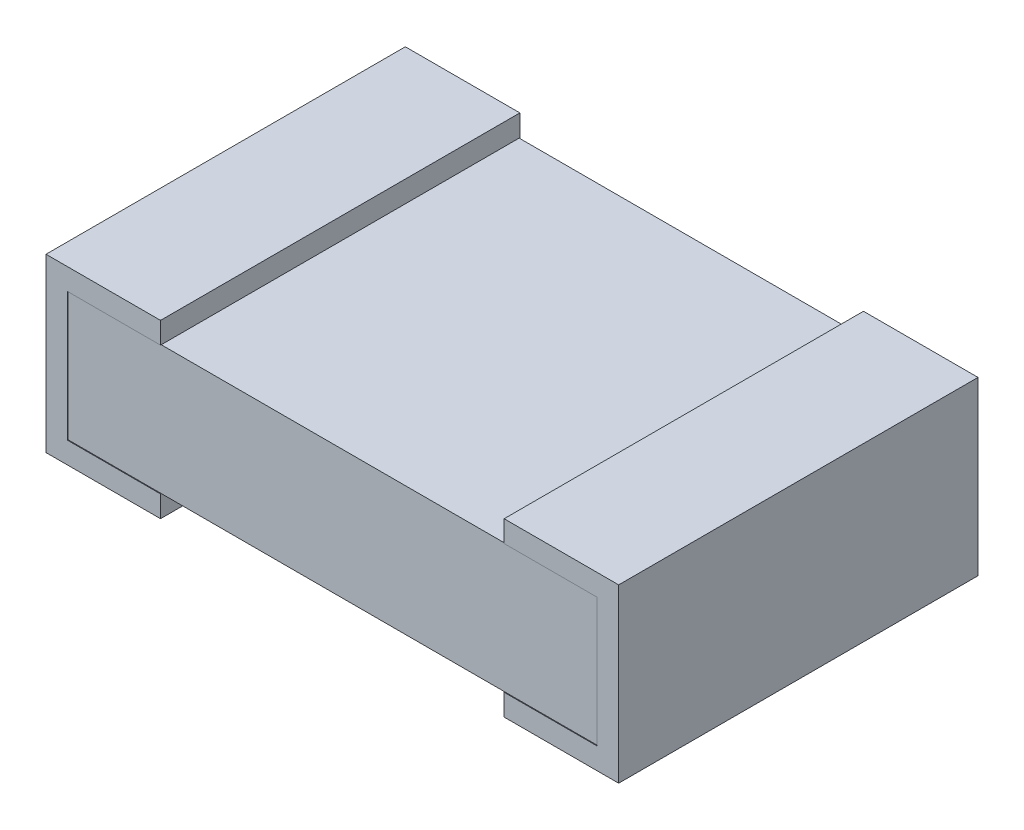
ISO-10303-21;
HEADER;
FILE_DESCRIPTION(('STEP AP214'),'2;1');
FILE_NAME('part.step','',(''),(''),'','','');
FILE_SCHEMA(('AUTOMOTIVE_DESIGN { 1 0 10303 214 1 1 1 1 }'));
ENDSEC;
DATA;
#1=APPLICATION_CONTEXT('core data for automotive mechanical design processes');
#2=APPLICATION_PROTOCOL_DEFINITION('international standard','automotive_design',2000,#1);
#3=PRODUCT_CONTEXT('',#1,'mechanical');
#4=PRODUCT('Part','Part','',(#3));
#5=PRODUCT_RELATED_PRODUCT_CATEGORY('part','',(#4));
#6=PRODUCT_DEFINITION_FORMATION('','',#4);
#7=PRODUCT_DEFINITION_CONTEXT('part definition',#1,'design');
#8=PRODUCT_DEFINITION('design','',#6,#7);
#9=PRODUCT_DEFINITION_SHAPE('','',#8);
#10=(LENGTH_UNIT() NAMED_UNIT(*) SI_UNIT(.MILLI.,.METRE.));
#11=(NAMED_UNIT(*) PLANE_ANGLE_UNIT() SI_UNIT($,.RADIAN.));
#12=(NAMED_UNIT(*) SI_UNIT($,.STERADIAN.) SOLID_ANGLE_UNIT());
#13=UNCERTAINTY_MEASURE_WITH_UNIT(LENGTH_MEASURE(1.E-05),#10,'distance_accuracy_value','');
#14=(GEOMETRIC_REPRESENTATION_CONTEXT(3) GLOBAL_UNCERTAINTY_ASSIGNED_CONTEXT((#13)) GLOBAL_UNIT_ASSIGNED_CONTEXT((#10,
#11,#12)) REPRESENTATION_CONTEXT('',''));
#15=CARTESIAN_POINT('',(0.,0.,0.));
#16=DIRECTION('',(0.,0.,1.));
#17=DIRECTION('',(1.,0.,0.));
#18=AXIS2_PLACEMENT_3D('',#15,#16,#17);
#19=CARTESIAN_POINT('',(1.9558,0.0762000000000002,-0.635));
#20=DIRECTION('',(0.,-1.,0.));
#21=DIRECTION('',(1.,0.,0.));
#22=AXIS2_PLACEMENT_3D('',#19,#20,#21);
#23=PLANE('',#22);
#24=DIRECTION('',(1.,0.,0.));
#25=VECTOR('',#24,1.);
#26=CARTESIAN_POINT('',(1.9558,0.0762000000000002,-0.635));
#27=LINE('',#26,#25);
#28=CARTESIAN_POINT('',(0.4064,0.0762000000000001,-0.635));
#29=VERTEX_POINT('',#28);
#30=CARTESIAN_POINT('',(1.6256,0.0762000000000001,-0.635));
#31=VERTEX_POINT('',#30);
#32=EDGE_CURVE('E40',#29,#31,#27,.T.);
#33=ORIENTED_EDGE('',*,*,#32,.T.);
#34=DIRECTION('',(0.,0.,-1.));
#35=VECTOR('',#34,1.);
#36=CARTESIAN_POINT('',(1.6256,0.0762000000000001,0.63754));
#37=LINE('',#36,#35);
#38=CARTESIAN_POINT('',(1.6256,0.0762000000000001,0.635));
#39=VERTEX_POINT('',#38);
#40=EDGE_CURVE('E271',#39,#31,#37,.T.);
#41=ORIENTED_EDGE('',*,*,#40,.F.);
#42=DIRECTION('',(1.,0.,0.));
#43=VECTOR('',#42,1.);
#44=CARTESIAN_POINT('',(1.9558,0.0762000000000002,0.635));
#45=LINE('',#44,#43);
#46=CARTESIAN_POINT('',(0.4064,0.0762000000000001,0.635));
#47=VERTEX_POINT('',#46);
#48=EDGE_CURVE('E370',#47,#39,#45,.T.);
#49=ORIENTED_EDGE('',*,*,#48,.F.);
#50=DIRECTION('',(0.,0.,-1.));
#51=VECTOR('',#50,1.);
#52=CARTESIAN_POINT('',(0.4064,0.0762000000000001,0.63754));
#53=LINE('',#52,#51);
#54=EDGE_CURVE('E332',#47,#29,#53,.T.);
#55=ORIENTED_EDGE('',*,*,#54,.T.);
#56=EDGE_LOOP('',(#33,#41,#49,#55));
#57=FACE_BOUND('',#56,.T.);
#58=ADVANCED_FACE('F31',(#57),#23,.T.);
#59=CARTESIAN_POINT('',(0.0762,0.5334,-0.635));
#60=DIRECTION('',(0.,1.,0.));
#61=DIRECTION('',(-1.,0.,0.));
#62=AXIS2_PLACEMENT_3D('',#59,#60,#61);
#63=PLANE('',#62);
#64=DIRECTION('',(-1.,0.,0.));
#65=VECTOR('',#64,1.);
#66=CARTESIAN_POINT('',(0.0762,0.5334,0.635));
#67=LINE('',#66,#65);
#68=CARTESIAN_POINT('',(1.6256,0.5334,0.635));
#69=VERTEX_POINT('',#68);
#70=CARTESIAN_POINT('',(0.4064,0.5334,0.635));
#71=VERTEX_POINT('',#70);
#72=EDGE_CURVE('E363',#69,#71,#67,.T.);
#73=ORIENTED_EDGE('',*,*,#72,.F.);
#74=DIRECTION('',(0.,0.,-1.));
#75=VECTOR('',#74,1.);
#76=CARTESIAN_POINT('',(1.6256,0.5334,0.63754));
#77=LINE('',#76,#75);
#78=CARTESIAN_POINT('',(1.6256,0.5334,-0.635));
#79=VERTEX_POINT('',#78);
#80=EDGE_CURVE('E260',#69,#79,#77,.T.);
#81=ORIENTED_EDGE('',*,*,#80,.T.);
#82=DIRECTION('',(-1.,0.,0.));
#83=VECTOR('',#82,1.);
#84=CARTESIAN_POINT('',(0.0762,0.5334,-0.635));
#85=LINE('',#84,#83);
#86=CARTESIAN_POINT('',(0.4064,0.5334,-0.635));
#87=VERTEX_POINT('',#86);
#88=EDGE_CURVE('E352',#79,#87,#85,.T.);
#89=ORIENTED_EDGE('',*,*,#88,.T.);
#90=DIRECTION('',(0.,0.,-1.));
#91=VECTOR('',#90,1.);
#92=CARTESIAN_POINT('',(0.4064,0.5334,0.63754));
#93=LINE('',#92,#91);
#94=EDGE_CURVE('E343',#71,#87,#93,.T.);
#95=ORIENTED_EDGE('',*,*,#94,.F.);
#96=EDGE_LOOP('',(#73,#81,#89,#95));
#97=FACE_BOUND('',#96,.T.);
#98=ADVANCED_FACE('F33',(#97),#63,.T.);
#99=CARTESIAN_POINT('',(1.9558,0.5334,-0.635));
#100=DIRECTION('',(0.,0.,-1.));
#101=DIRECTION('',(-1.,0.,0.));
#102=AXIS2_PLACEMENT_3D('',#99,#100,#101);
#103=PLANE('',#102);
#104=DIRECTION('',(0.,1.,0.));
#105=VECTOR('',#104,1.);
#106=CARTESIAN_POINT('',(1.9558,0.0762000000000002,-0.635));
#107=LINE('',#106,#105);
#108=CARTESIAN_POINT('',(1.9558,0.0762,-0.635));
#109=VERTEX_POINT('',#108);
#110=CARTESIAN_POINT('',(1.9558,0.5334,-0.635));
#111=VERTEX_POINT('',#110);
#112=EDGE_CURVE('E350',#109,#111,#107,.T.);
#113=ORIENTED_EDGE('',*,*,#112,.F.);
#114=DIRECTION('',(-1.,0.,0.));
#115=VECTOR('',#114,1.);
#116=CARTESIAN_POINT('',(1.9558,0.0762,-0.635));
#117=LINE('',#116,#115);
#118=EDGE_CURVE('E253',#109,#31,#117,.T.);
#119=ORIENTED_EDGE('',*,*,#118,.T.);
#120=ORIENTED_EDGE('',*,*,#32,.F.);
#121=CARTESIAN_POINT('',(0.0762,0.0762,-0.635));
#122=VERTEX_POINT('',#121);
#123=EDGE_CURVE('E11',#122,#29,#27,.T.);
#124=ORIENTED_EDGE('',*,*,#123,.F.);
#125=DIRECTION('',(0.,-1.,0.));
#126=VECTOR('',#125,1.);
#127=CARTESIAN_POINT('',(0.0762,0.5334,-0.635));
#128=LINE('',#127,#126);
#129=CARTESIAN_POINT('',(0.0762,0.5334,-0.635));
#130=VERTEX_POINT('',#129);
#131=EDGE_CURVE('E355',#130,#122,#128,.T.);
#132=ORIENTED_EDGE('',*,*,#131,.F.);
#133=DIRECTION('',(-1.,0.,0.));
#134=VECTOR('',#133,1.);
#135=CARTESIAN_POINT('',(1.9558,0.5334,-0.635));
#136=LINE('',#135,#134);
#137=EDGE_CURVE('E326',#87,#130,#136,.T.);
#138=ORIENTED_EDGE('',*,*,#137,.F.);
#139=ORIENTED_EDGE('',*,*,#88,.F.);
#140=EDGE_CURVE('E353',#111,#79,#85,.T.);
#141=ORIENTED_EDGE('',*,*,#140,.F.);
#142=EDGE_LOOP('',(#113,#119,#120,#124,#132,#138,#139,#141));
#143=FACE_BOUND('',#142,.T.);
#144=ADVANCED_FACE('F434',(#143),#103,.T.);
#145=CARTESIAN_POINT('',(1.9558,0.5334,0.635));
#146=DIRECTION('',(0.,0.,-1.));
#147=DIRECTION('',(-1.,0.,0.));
#148=AXIS2_PLACEMENT_3D('',#145,#146,#147);
#149=PLANE('',#148);
#150=DIRECTION('',(0.,1.,0.));
#151=VECTOR('',#150,1.);
#152=CARTESIAN_POINT('',(1.9558,0.0762000000000002,0.635));
#153=LINE('',#152,#151);
#154=CARTESIAN_POINT('',(1.9558,0.0762000000000002,0.635));
#155=VERTEX_POINT('',#154);
#156=CARTESIAN_POINT('',(1.9558,0.5334,0.635));
#157=VERTEX_POINT('',#156);
#158=EDGE_CURVE('E349',#155,#157,#153,.T.);
#159=ORIENTED_EDGE('',*,*,#158,.T.);
#160=EDGE_CURVE('E360',#157,#69,#67,.T.);
#161=ORIENTED_EDGE('',*,*,#160,.T.);
#162=ORIENTED_EDGE('',*,*,#72,.T.);
#163=CARTESIAN_POINT('',(0.0762,0.5334,0.635));
#164=VERTEX_POINT('',#163);
#165=EDGE_CURVE('E359',#71,#164,#67,.T.);
#166=ORIENTED_EDGE('',*,*,#165,.T.);
#167=DIRECTION('',(0.,-1.,0.));
#168=VECTOR('',#167,1.);
#169=CARTESIAN_POINT('',(0.0762,0.5334,0.635));
#170=LINE('',#169,#168);
#171=CARTESIAN_POINT('',(0.0762,0.0762,0.635));
#172=VERTEX_POINT('',#171);
#173=EDGE_CURVE('E362',#164,#172,#170,.T.);
#174=ORIENTED_EDGE('',*,*,#173,.T.);
#175=EDGE_CURVE('E35',#172,#47,#45,.T.);
#176=ORIENTED_EDGE('',*,*,#175,.T.);
#177=ORIENTED_EDGE('',*,*,#48,.T.);
#178=EDGE_CURVE('E365',#39,#155,#45,.T.);
#179=ORIENTED_EDGE('',*,*,#178,.T.);
#180=EDGE_LOOP('',(#159,#161,#162,#166,#174,#176,#177,#179));
#181=FACE_BOUND('',#180,.T.);
#182=ADVANCED_FACE('F372',(#181),#149,.F.);
#183=CARTESIAN_POINT('',(0.0762,0.0762,0.63754));
#184=DIRECTION('',(0.,1.,0.));
#185=DIRECTION('',(-1.,0.,0.));
#186=AXIS2_PLACEMENT_3D('',#183,#184,#185);
#187=PLANE('',#186);
#188=ORIENTED_EDGE('',*,*,#175,.F.);
#189=DIRECTION('',(0.,0.,-1.));
#190=VECTOR('',#189,1.);
#191=CARTESIAN_POINT('',(0.0762,0.0762,0.63754));
#192=LINE('',#191,#190);
#193=CARTESIAN_POINT('',(0.0762,0.0762,0.63754));
#194=VERTEX_POINT('',#193);
#195=EDGE_CURVE('E334',#194,#172,#192,.T.);
#196=ORIENTED_EDGE('',*,*,#195,.F.);
#197=DIRECTION('',(1.,0.,0.));
#198=VECTOR('',#197,1.);
#199=CARTESIAN_POINT('',(0.0762,0.0762,0.63754));
#200=LINE('',#199,#198);
#201=CARTESIAN_POINT('',(0.4064,0.0762000000000001,0.63754));
#202=VERTEX_POINT('',#201);
#203=EDGE_CURVE('E292',#194,#202,#200,.T.);
#204=ORIENTED_EDGE('',*,*,#203,.T.);
#205=EDGE_CURVE('E329',#202,#47,#53,.T.);
#206=ORIENTED_EDGE('',*,*,#205,.T.);
#207=EDGE_LOOP('',(#188,#196,#204,#206));
#208=FACE_BOUND('',#207,.T.);
#209=ADVANCED_FACE('F375',(#208),#187,.T.);
#210=CARTESIAN_POINT('',(0.0762,0.5334,0.63754));
#211=DIRECTION('',(1.,0.,0.));
#212=DIRECTION('',(0.,0.,-1.));
#213=AXIS2_PLACEMENT_3D('',#210,#211,#212);
#214=PLANE('',#213);
#215=ORIENTED_EDGE('',*,*,#173,.F.);
#216=DIRECTION('',(0.,0.,-1.));
#217=VECTOR('',#216,1.);
#218=CARTESIAN_POINT('',(0.0762,0.5334,0.63754));
#219=LINE('',#218,#217);
#220=CARTESIAN_POINT('',(0.0762,0.5334,0.63754));
#221=VERTEX_POINT('',#220);
#222=EDGE_CURVE('E56',#221,#164,#219,.T.);
#223=ORIENTED_EDGE('',*,*,#222,.F.);
#224=DIRECTION('',(0.,-1.,0.));
#225=VECTOR('',#224,1.);
#226=CARTESIAN_POINT('',(0.0762,0.5334,0.63754));
#227=LINE('',#226,#225);
#228=EDGE_CURVE('E289',#221,#194,#227,.T.);
#229=ORIENTED_EDGE('',*,*,#228,.T.);
#230=ORIENTED_EDGE('',*,*,#195,.T.);
#231=EDGE_LOOP('',(#215,#223,#229,#230));
#232=FACE_BOUND('',#231,.T.);
#233=ADVANCED_FACE('F378',(#232),#214,.T.);
#234=CARTESIAN_POINT('',(0.4064,0.5334,0.63754));
#235=DIRECTION('',(0.,-1.,0.));
#236=DIRECTION('',(0.,0.,-1.));
#237=AXIS2_PLACEMENT_3D('',#234,#235,#236);
#238=PLANE('',#237);
#239=ORIENTED_EDGE('',*,*,#165,.F.);
#240=CARTESIAN_POINT('',(0.4064,0.5334,0.63754));
#241=VERTEX_POINT('',#240);
#242=EDGE_CURVE('E340',#241,#71,#93,.T.);
#243=ORIENTED_EDGE('',*,*,#242,.F.);
#244=DIRECTION('',(-1.,0.,0.));
#245=VECTOR('',#244,1.);
#246=CARTESIAN_POINT('',(0.4064,0.5334,0.63754));
#247=LINE('',#246,#245);
#248=EDGE_CURVE('E287',#241,#221,#247,.T.);
#249=ORIENTED_EDGE('',*,*,#248,.T.);
#250=ORIENTED_EDGE('',*,*,#222,.T.);
#251=EDGE_LOOP('',(#239,#243,#249,#250));
#252=FACE_BOUND('',#251,.T.);
#253=ADVANCED_FACE('F386',(#252),#238,.T.);
#254=CARTESIAN_POINT('',(0.,0.,0.63754));
#255=DIRECTION('',(-1.,0.,0.));
#256=DIRECTION('',(0.,0.,1.));
#257=AXIS2_PLACEMENT_3D('',#254,#255,#256);
#258=PLANE('',#257);
#259=DIRECTION('',(0.,1.,0.));
#260=VECTOR('',#259,1.);
#261=CARTESIAN_POINT('',(0.,0.,-0.63754));
#262=LINE('',#261,#260);
#263=CARTESIAN_POINT('',(0.,0.,-0.63754));
#264=VERTEX_POINT('',#263);
#265=CARTESIAN_POINT('',(0.,0.6096,-0.63754));
#266=VERTEX_POINT('',#265);
#267=EDGE_CURVE('E276',#264,#266,#262,.T.);
#268=ORIENTED_EDGE('',*,*,#267,.F.);
#269=DIRECTION('',(0.,0.,-1.));
#270=VECTOR('',#269,1.);
#271=CARTESIAN_POINT('',(0.,0.,0.63754));
#272=LINE('',#271,#270);
#273=CARTESIAN_POINT('',(0.,0.,0.63754));
#274=VERTEX_POINT('',#273);
#275=EDGE_CURVE('E324',#274,#264,#272,.T.);
#276=ORIENTED_EDGE('',*,*,#275,.F.);
#277=DIRECTION('',(0.,1.,0.));
#278=VECTOR('',#277,1.);
#279=CARTESIAN_POINT('',(0.,0.,0.63754));
#280=LINE('',#279,#278);
#281=CARTESIAN_POINT('',(0.,0.6096,0.63754));
#282=VERTEX_POINT('',#281);
#283=EDGE_CURVE('E277',#274,#282,#280,.T.);
#284=ORIENTED_EDGE('',*,*,#283,.T.);
#285=DIRECTION('',(0.,0.,-1.));
#286=VECTOR('',#285,1.);
#287=CARTESIAN_POINT('',(0.,0.6096,0.63754));
#288=LINE('',#287,#286);
#289=EDGE_CURVE('E301',#282,#266,#288,.T.);
#290=ORIENTED_EDGE('',*,*,#289,.T.);
#291=EDGE_LOOP('',(#268,#276,#284,#290));
#292=FACE_BOUND('',#291,.T.);
#293=ADVANCED_FACE('F412',(#292),#258,.T.);
#294=CARTESIAN_POINT('',(0.,0.,0.63754));
#295=DIRECTION('',(0.,-1.,0.));
#296=DIRECTION('',(1.,0.,0.));
#297=AXIS2_PLACEMENT_3D('',#294,#295,#296);
#298=PLANE('',#297);
#299=DIRECTION('',(-1.,0.,0.));
#300=VECTOR('',#299,1.);
#301=CARTESIAN_POINT('',(0.,0.,-0.63754));
#302=LINE('',#301,#300);
#303=CARTESIAN_POINT('',(0.4064,0.,-0.63754));
#304=VERTEX_POINT('',#303);
#305=EDGE_CURVE('E281',#304,#264,#302,.T.);
#306=ORIENTED_EDGE('',*,*,#305,.F.);
#307=DIRECTION('',(0.,0.,-1.));
#308=VECTOR('',#307,1.);
#309=CARTESIAN_POINT('',(0.4064,0.,0.63754));
#310=LINE('',#309,#308);
#311=CARTESIAN_POINT('',(0.4064,0.,0.63754));
#312=VERTEX_POINT('',#311);
#313=EDGE_CURVE('E327',#312,#304,#310,.T.);
#314=ORIENTED_EDGE('',*,*,#313,.F.);
#315=DIRECTION('',(-1.,0.,0.));
#316=VECTOR('',#315,1.);
#317=CARTESIAN_POINT('',(0.,0.,0.63754));
#318=LINE('',#317,#316);
#319=EDGE_CURVE('E298',#312,#274,#318,.T.);
#320=ORIENTED_EDGE('',*,*,#319,.T.);
#321=ORIENTED_EDGE('',*,*,#275,.T.);
#322=EDGE_LOOP('',(#306,#314,#320,#321));
#323=FACE_BOUND('',#322,.T.);
#324=ADVANCED_FACE('F415',(#323),#298,.T.);
#325=CARTESIAN_POINT('',(0.4064,0.,0.63754));
#326=DIRECTION('',(1.,0.,0.));
#327=DIRECTION('',(0.,0.,-1.));
#328=AXIS2_PLACEMENT_3D('',#325,#326,#327);
#329=PLANE('',#328);
#330=DIRECTION('',(0.,-1.,0.));
#331=VECTOR('',#330,1.);
#332=CARTESIAN_POINT('',(0.4064,0.,-0.63754));
#333=LINE('',#332,#331);
#334=CARTESIAN_POINT('',(0.4064,0.0762000000000001,-0.63754));
#335=VERTEX_POINT('',#334);
#336=EDGE_CURVE('E319',#335,#304,#333,.T.);
#337=ORIENTED_EDGE('',*,*,#336,.F.);
#338=EDGE_CURVE('E333',#29,#335,#53,.T.);
#339=ORIENTED_EDGE('',*,*,#338,.F.);
#340=ORIENTED_EDGE('',*,*,#54,.F.);
#341=ORIENTED_EDGE('',*,*,#205,.F.);
#342=DIRECTION('',(0.,-1.,0.));
#343=VECTOR('',#342,1.);
#344=CARTESIAN_POINT('',(0.4064,0.,0.63754));
#345=LINE('',#344,#343);
#346=EDGE_CURVE('E295',#202,#312,#345,.T.);
#347=ORIENTED_EDGE('',*,*,#346,.T.);
#348=ORIENTED_EDGE('',*,*,#313,.T.);
#349=EDGE_LOOP('',(#337,#339,#340,#341,#347,#348));
#350=FACE_BOUND('',#349,.T.);
#351=ADVANCED_FACE('F418',(#350),#329,.T.);
#352=CARTESIAN_POINT('',(0.0762,0.0762,-0.63754));
#353=VERTEX_POINT('',#352);
#354=EDGE_CURVE('E337',#122,#353,#192,.T.);
#355=ORIENTED_EDGE('',*,*,#354,.F.);
#356=ORIENTED_EDGE('',*,*,#123,.T.);
#357=ORIENTED_EDGE('',*,*,#338,.T.);
#358=DIRECTION('',(1.,0.,0.));
#359=VECTOR('',#358,1.);
#360=CARTESIAN_POINT('',(0.0762,0.0762,-0.63754));
#361=LINE('',#360,#359);
#362=EDGE_CURVE('E316',#353,#335,#361,.T.);
#363=ORIENTED_EDGE('',*,*,#362,.F.);
#364=EDGE_LOOP('',(#355,#356,#357,#363));
#365=FACE_BOUND('',#364,.T.);
#366=ADVANCED_FACE('F427',(#365),#187,.T.);
#367=CARTESIAN_POINT('',(0.0762,0.5334,-0.63754));
#368=VERTEX_POINT('',#367);
#369=EDGE_CURVE('E339',#130,#368,#219,.T.);
#370=ORIENTED_EDGE('',*,*,#369,.F.);
#371=ORIENTED_EDGE('',*,*,#131,.T.);
#372=ORIENTED_EDGE('',*,*,#354,.T.);
#373=DIRECTION('',(0.,-1.,0.));
#374=VECTOR('',#373,1.);
#375=CARTESIAN_POINT('',(0.0762,0.5334,-0.63754));
#376=LINE('',#375,#374);
#377=EDGE_CURVE('E313',#368,#353,#376,.T.);
#378=ORIENTED_EDGE('',*,*,#377,.F.);
#379=EDGE_LOOP('',(#370,#371,#372,#378));
#380=FACE_BOUND('',#379,.T.);
#381=ADVANCED_FACE('F430',(#380),#214,.T.);
#382=CARTESIAN_POINT('',(0.4064,0.5334,-0.63754));
#383=VERTEX_POINT('',#382);
#384=EDGE_CURVE('E344',#87,#383,#93,.T.);
#385=ORIENTED_EDGE('',*,*,#384,.F.);
#386=ORIENTED_EDGE('',*,*,#137,.T.);
#387=ORIENTED_EDGE('',*,*,#369,.T.);
#388=DIRECTION('',(-1.,0.,0.));
#389=VECTOR('',#388,1.);
#390=CARTESIAN_POINT('',(0.4064,0.5334,-0.63754));
#391=LINE('',#390,#389);
#392=EDGE_CURVE('E310',#383,#368,#391,.T.);
#393=ORIENTED_EDGE('',*,*,#392,.F.);
#394=EDGE_LOOP('',(#385,#386,#387,#393));
#395=FACE_BOUND('',#394,.T.);
#396=ADVANCED_FACE('F400',(#395),#238,.T.);
#397=CARTESIAN_POINT('',(0.4064,0.6096,0.63754));
#398=DIRECTION('',(1.,0.,0.));
#399=DIRECTION('',(0.,1.,0.));
#400=AXIS2_PLACEMENT_3D('',#397,#398,#399);
#401=PLANE('',#400);
#402=DIRECTION('',(0.,-1.,0.));
#403=VECTOR('',#402,1.);
#404=CARTESIAN_POINT('',(0.4064,0.6096,-0.63754));
#405=LINE('',#404,#403);
#406=CARTESIAN_POINT('',(0.4064,0.6096,-0.63754));
#407=VERTEX_POINT('',#406);
#408=EDGE_CURVE('E307',#407,#383,#405,.T.);
#409=ORIENTED_EDGE('',*,*,#408,.F.);
#410=DIRECTION('',(0.,0.,-1.));
#411=VECTOR('',#410,1.);
#412=CARTESIAN_POINT('',(0.4064,0.6096,0.63754));
#413=LINE('',#412,#411);
#414=CARTESIAN_POINT('',(0.4064,0.6096,0.63754));
#415=VERTEX_POINT('',#414);
#416=EDGE_CURVE('E345',#415,#407,#413,.T.);
#417=ORIENTED_EDGE('',*,*,#416,.F.);
#418=DIRECTION('',(0.,-1.,0.));
#419=VECTOR('',#418,1.);
#420=CARTESIAN_POINT('',(0.4064,0.6096,0.63754));
#421=LINE('',#420,#419);
#422=EDGE_CURVE('E284',#415,#241,#421,.T.);
#423=ORIENTED_EDGE('',*,*,#422,.T.);
#424=ORIENTED_EDGE('',*,*,#242,.T.);
#425=ORIENTED_EDGE('',*,*,#94,.T.);
#426=ORIENTED_EDGE('',*,*,#384,.T.);
#427=EDGE_LOOP('',(#409,#417,#423,#424,#425,#426));
#428=FACE_BOUND('',#427,.T.);
#429=ADVANCED_FACE('F391',(#428),#401,.T.);
#430=CARTESIAN_POINT('',(0.,0.6096,0.63754));
#431=DIRECTION('',(0.,1.,0.));
#432=DIRECTION('',(0.,0.,1.));
#433=AXIS2_PLACEMENT_3D('',#430,#431,#432);
#434=PLANE('',#433);
#435=DIRECTION('',(1.,0.,0.));
#436=VECTOR('',#435,1.);
#437=CARTESIAN_POINT('',(0.,0.6096,-0.63754));
#438=LINE('',#437,#436);
#439=EDGE_CURVE('E304',#266,#407,#438,.T.);
#440=ORIENTED_EDGE('',*,*,#439,.F.);
#441=ORIENTED_EDGE('',*,*,#289,.F.);
#442=DIRECTION('',(1.,0.,0.));
#443=VECTOR('',#442,1.);
#444=CARTESIAN_POINT('',(0.,0.6096,0.63754));
#445=LINE('',#444,#443);
#446=EDGE_CURVE('E280',#282,#415,#445,.T.);
#447=ORIENTED_EDGE('',*,*,#446,.T.);
#448=ORIENTED_EDGE('',*,*,#416,.T.);
#449=EDGE_LOOP('',(#440,#441,#447,#448));
#450=FACE_BOUND('',#449,.T.);
#451=ADVANCED_FACE('F408',(#450),#434,.T.);
#452=CARTESIAN_POINT('',(0.,0.6096,0.63754));
#453=DIRECTION('',(0.,0.,-1.));
#454=DIRECTION('',(-1.,0.,0.));
#455=AXIS2_PLACEMENT_3D('',#452,#453,#454);
#456=PLANE('',#455);
#457=ORIENTED_EDGE('',*,*,#283,.F.);
#458=ORIENTED_EDGE('',*,*,#319,.F.);
#459=ORIENTED_EDGE('',*,*,#346,.F.);
#460=ORIENTED_EDGE('',*,*,#203,.F.);
#461=ORIENTED_EDGE('',*,*,#228,.F.);
#462=ORIENTED_EDGE('',*,*,#248,.F.);
#463=ORIENTED_EDGE('',*,*,#422,.F.);
#464=ORIENTED_EDGE('',*,*,#446,.F.);
#465=EDGE_LOOP('',(#457,#458,#459,#460,#461,#462,#463,#464));
#466=FACE_BOUND('',#465,.T.);
#467=ADVANCED_FACE('F383',(#466),#456,.F.);
#468=CARTESIAN_POINT('',(0.,0.6096,-0.63754));
#469=DIRECTION('',(0.,0.,-1.));
#470=DIRECTION('',(-1.,0.,0.));
#471=AXIS2_PLACEMENT_3D('',#468,#469,#470);
#472=PLANE('',#471);
#473=ORIENTED_EDGE('',*,*,#267,.T.);
#474=ORIENTED_EDGE('',*,*,#439,.T.);
#475=ORIENTED_EDGE('',*,*,#408,.T.);
#476=ORIENTED_EDGE('',*,*,#392,.T.);
#477=ORIENTED_EDGE('',*,*,#377,.T.);
#478=ORIENTED_EDGE('',*,*,#362,.T.);
#479=ORIENTED_EDGE('',*,*,#336,.T.);
#480=ORIENTED_EDGE('',*,*,#305,.T.);
#481=EDGE_LOOP('',(#473,#474,#475,#476,#477,#478,#479,#480));
#482=FACE_BOUND('',#481,.T.);
#483=ADVANCED_FACE('F404',(#482),#472,.T.);
#484=CARTESIAN_POINT('',(1.6256,0.5334,0.63754));
#485=DIRECTION('',(0.,1.,0.));
#486=DIRECTION('',(0.,0.,1.));
#487=AXIS2_PLACEMENT_3D('',#484,#485,#486);
#488=PLANE('',#487);
#489=CARTESIAN_POINT('',(1.6256,0.5334,0.63754));
#490=VERTEX_POINT('',#489);
#491=EDGE_CURVE('E257',#490,#69,#77,.T.);
#492=ORIENTED_EDGE('',*,*,#491,.T.);
#493=ORIENTED_EDGE('',*,*,#160,.F.);
#494=DIRECTION('',(0.,0.,-1.));
#495=VECTOR('',#494,1.);
#496=CARTESIAN_POINT('',(1.9558,0.5334,0.63754));
#497=LINE('',#496,#495);
#498=CARTESIAN_POINT('',(1.9558,0.5334,0.63754));
#499=VERTEX_POINT('',#498);
#500=EDGE_CURVE('E262',#499,#157,#497,.T.);
#501=ORIENTED_EDGE('',*,*,#500,.F.);
#502=DIRECTION('',(1.,0.,0.));
#503=VECTOR('',#502,1.);
#504=CARTESIAN_POINT('',(1.6256,0.5334,0.63754));
#505=LINE('',#504,#503);
#506=EDGE_CURVE('E231',#490,#499,#505,.T.);
#507=ORIENTED_EDGE('',*,*,#506,.F.);
#508=EDGE_LOOP('',(#492,#493,#501,#507));
#509=FACE_BOUND('',#508,.T.);
#510=ADVANCED_FACE('F460',(#509),#488,.F.);
#511=CARTESIAN_POINT('',(1.9558,0.5334,0.63754));
#512=DIRECTION('',(1.,0.,0.));
#513=DIRECTION('',(0.,0.,-1.));
#514=AXIS2_PLACEMENT_3D('',#511,#512,#513);
#515=PLANE('',#514);
#516=ORIENTED_EDGE('',*,*,#500,.T.);
#517=ORIENTED_EDGE('',*,*,#158,.F.);
#518=DIRECTION('',(0.,0.,-1.));
#519=VECTOR('',#518,1.);
#520=CARTESIAN_POINT('',(1.9558,0.0762,0.63754));
#521=LINE('',#520,#519);
#522=CARTESIAN_POINT('',(1.9558,0.0762,0.63754));
#523=VERTEX_POINT('',#522);
#524=EDGE_CURVE('E48',#523,#155,#521,.T.);
#525=ORIENTED_EDGE('',*,*,#524,.F.);
#526=DIRECTION('',(0.,-1.,0.));
#527=VECTOR('',#526,1.);
#528=CARTESIAN_POINT('',(1.9558,0.5334,0.63754));
#529=LINE('',#528,#527);
#530=EDGE_CURVE('E229',#499,#523,#529,.T.);
#531=ORIENTED_EDGE('',*,*,#530,.F.);
#532=EDGE_LOOP('',(#516,#517,#525,#531));
#533=FACE_BOUND('',#532,.T.);
#534=ADVANCED_FACE('F463',(#533),#515,.F.);
#535=CARTESIAN_POINT('',(1.9558,0.0762,0.63754));
#536=DIRECTION('',(0.,-1.,0.));
#537=DIRECTION('',(1.,0.,0.));
#538=AXIS2_PLACEMENT_3D('',#535,#536,#537);
#539=PLANE('',#538);
#540=ORIENTED_EDGE('',*,*,#524,.T.);
#541=ORIENTED_EDGE('',*,*,#178,.F.);
#542=CARTESIAN_POINT('',(1.6256,0.0762000000000001,0.63754));
#543=VERTEX_POINT('',#542);
#544=EDGE_CURVE('E268',#543,#39,#37,.T.);
#545=ORIENTED_EDGE('',*,*,#544,.F.);
#546=DIRECTION('',(-1.,0.,0.));
#547=VECTOR('',#546,1.);
#548=CARTESIAN_POINT('',(1.9558,0.0762,0.63754));
#549=LINE('',#548,#547);
#550=EDGE_CURVE('E227',#523,#543,#549,.T.);
#551=ORIENTED_EDGE('',*,*,#550,.F.);
#552=EDGE_LOOP('',(#540,#541,#545,#551));
#553=FACE_BOUND('',#552,.T.);
#554=ADVANCED_FACE('F465',(#553),#539,.F.);
#555=CARTESIAN_POINT('',(2.032,0.,0.63754));
#556=DIRECTION('',(-1.,0.,0.));
#557=DIRECTION('',(0.,0.,1.));
#558=AXIS2_PLACEMENT_3D('',#555,#556,#557);
#559=PLANE('',#558);
#560=DIRECTION('',(0.,1.,0.));
#561=VECTOR('',#560,1.);
#562=CARTESIAN_POINT('',(2.032,0.,-0.63754));
#563=LINE('',#562,#561);
#564=CARTESIAN_POINT('',(2.032,0.,-0.63754));
#565=VERTEX_POINT('',#564);
#566=CARTESIAN_POINT('',(2.032,0.6096,-0.63754));
#567=VERTEX_POINT('',#566);
#568=EDGE_CURVE('E236',#565,#567,#563,.T.);
#569=ORIENTED_EDGE('',*,*,#568,.T.);
#570=DIRECTION('',(0.,0.,-1.));
#571=VECTOR('',#570,1.);
#572=CARTESIAN_POINT('',(2.032,0.6096,0.63754));
#573=LINE('',#572,#571);
#574=CARTESIAN_POINT('',(2.032,0.6096,0.63754));
#575=VERTEX_POINT('',#574);
#576=EDGE_CURVE('E220',#575,#567,#573,.T.);
#577=ORIENTED_EDGE('',*,*,#576,.F.);
#578=DIRECTION('',(0.,1.,0.));
#579=VECTOR('',#578,1.);
#580=CARTESIAN_POINT('',(2.032,0.,0.63754));
#581=LINE('',#580,#579);
#582=CARTESIAN_POINT('',(2.032,0.,0.63754));
#583=VERTEX_POINT('',#582);
#584=EDGE_CURVE('E199',#583,#575,#581,.T.);
#585=ORIENTED_EDGE('',*,*,#584,.F.);
#586=DIRECTION('',(0.,0.,-1.));
#587=VECTOR('',#586,1.);
#588=CARTESIAN_POINT('',(2.032,0.,0.63754));
#589=LINE('',#588,#587);
#590=EDGE_CURVE('E208',#583,#565,#589,.T.);
#591=ORIENTED_EDGE('',*,*,#590,.T.);
#592=EDGE_LOOP('',(#569,#577,#585,#591));
#593=FACE_BOUND('',#592,.T.);
#594=ADVANCED_FACE('F218',(#593),#559,.F.);
#595=CARTESIAN_POINT('',(2.032,0.6096,0.63754));
#596=DIRECTION('',(0.,-1.,0.));
#597=DIRECTION('',(0.,0.,-1.));
#598=AXIS2_PLACEMENT_3D('',#595,#596,#597);
#599=PLANE('',#598);
#600=DIRECTION('',(-1.,0.,0.));
#601=VECTOR('',#600,1.);
#602=CARTESIAN_POINT('',(2.032,0.6096,-0.63754));
#603=LINE('',#602,#601);
#604=CARTESIAN_POINT('',(1.6256,0.6096,-0.63754));
#605=VERTEX_POINT('',#604);
#606=EDGE_CURVE('E221',#567,#605,#603,.T.);
#607=ORIENTED_EDGE('',*,*,#606,.T.);
#608=DIRECTION('',(0.,0.,-1.));
#609=VECTOR('',#608,1.);
#610=CARTESIAN_POINT('',(1.6256,0.6096,0.63754));
#611=LINE('',#610,#609);
#612=CARTESIAN_POINT('',(1.6256,0.6096,0.63754));
#613=VERTEX_POINT('',#612);
#614=EDGE_CURVE('E254',#613,#605,#611,.T.);
#615=ORIENTED_EDGE('',*,*,#614,.F.);
#616=DIRECTION('',(-1.,0.,0.));
#617=VECTOR('',#616,1.);
#618=CARTESIAN_POINT('',(2.032,0.6096,0.63754));
#619=LINE('',#618,#617);
#620=EDGE_CURVE('E216',#575,#613,#619,.T.);
#621=ORIENTED_EDGE('',*,*,#620,.F.);
#622=ORIENTED_EDGE('',*,*,#576,.T.);
#623=EDGE_LOOP('',(#607,#615,#621,#622));
#624=FACE_BOUND('',#623,.T.);
#625=ADVANCED_FACE('F451',(#624),#599,.F.);
#626=CARTESIAN_POINT('',(1.6256,0.6096,0.63754));
#627=DIRECTION('',(1.,0.,0.));
#628=DIRECTION('',(0.,1.,0.));
#629=AXIS2_PLACEMENT_3D('',#626,#627,#628);
#630=PLANE('',#629);
#631=DIRECTION('',(0.,-1.,0.));
#632=VECTOR('',#631,1.);
#633=CARTESIAN_POINT('',(1.6256,0.6096,-0.63754));
#634=LINE('',#633,#632);
#635=CARTESIAN_POINT('',(1.6256,0.5334,-0.63754));
#636=VERTEX_POINT('',#635);
#637=EDGE_CURVE('E223',#605,#636,#634,.T.);
#638=ORIENTED_EDGE('',*,*,#637,.T.);
#639=EDGE_CURVE('E261',#79,#636,#77,.T.);
#640=ORIENTED_EDGE('',*,*,#639,.F.);
#641=ORIENTED_EDGE('',*,*,#80,.F.);
#642=ORIENTED_EDGE('',*,*,#491,.F.);
#643=DIRECTION('',(0.,-1.,0.));
#644=VECTOR('',#643,1.);
#645=CARTESIAN_POINT('',(1.6256,0.6096,0.63754));
#646=LINE('',#645,#644);
#647=EDGE_CURVE('E233',#613,#490,#646,.T.);
#648=ORIENTED_EDGE('',*,*,#647,.F.);
#649=ORIENTED_EDGE('',*,*,#614,.T.);
#650=EDGE_LOOP('',(#638,#640,#641,#642,#648,#649));
#651=FACE_BOUND('',#650,.T.);
#652=ADVANCED_FACE('F457',(#651),#630,.F.);
#653=ORIENTED_EDGE('',*,*,#140,.T.);
#654=ORIENTED_EDGE('',*,*,#639,.T.);
#655=DIRECTION('',(1.,0.,0.));
#656=VECTOR('',#655,1.);
#657=CARTESIAN_POINT('',(1.6256,0.5334,-0.63754));
#658=LINE('',#657,#656);
#659=CARTESIAN_POINT('',(1.9558,0.5334,-0.63754));
#660=VERTEX_POINT('',#659);
#661=EDGE_CURVE('E247',#636,#660,#658,.T.);
#662=ORIENTED_EDGE('',*,*,#661,.T.);
#663=EDGE_CURVE('E265',#111,#660,#497,.T.);
#664=ORIENTED_EDGE('',*,*,#663,.F.);
#665=EDGE_LOOP('',(#653,#654,#662,#664));
#666=FACE_BOUND('',#665,.T.);
#667=ADVANCED_FACE('F548',(#666),#488,.F.);
#668=ORIENTED_EDGE('',*,*,#112,.T.);
#669=ORIENTED_EDGE('',*,*,#663,.T.);
#670=DIRECTION('',(0.,-1.,0.));
#671=VECTOR('',#670,1.);
#672=CARTESIAN_POINT('',(1.9558,0.5334,-0.63754));
#673=LINE('',#672,#671);
#674=CARTESIAN_POINT('',(1.9558,0.0762,-0.63754));
#675=VERTEX_POINT('',#674);
#676=EDGE_CURVE('E244',#660,#675,#673,.T.);
#677=ORIENTED_EDGE('',*,*,#676,.T.);
#678=EDGE_CURVE('E267',#109,#675,#521,.T.);
#679=ORIENTED_EDGE('',*,*,#678,.F.);
#680=EDGE_LOOP('',(#668,#669,#677,#679));
#681=FACE_BOUND('',#680,.T.);
#682=ADVANCED_FACE('F474',(#681),#515,.F.);
#683=ORIENTED_EDGE('',*,*,#118,.F.);
#684=ORIENTED_EDGE('',*,*,#678,.T.);
#685=DIRECTION('',(-1.,0.,0.));
#686=VECTOR('',#685,1.);
#687=CARTESIAN_POINT('',(1.9558,0.0762,-0.63754));
#688=LINE('',#687,#686);
#689=CARTESIAN_POINT('',(1.6256,0.0762000000000001,-0.63754));
#690=VERTEX_POINT('',#689);
#691=EDGE_CURVE('E241',#675,#690,#688,.T.);
#692=ORIENTED_EDGE('',*,*,#691,.T.);
#693=EDGE_CURVE('E272',#31,#690,#37,.T.);
#694=ORIENTED_EDGE('',*,*,#693,.F.);
#695=EDGE_LOOP('',(#683,#684,#692,#694));
#696=FACE_BOUND('',#695,.T.);
#697=ADVANCED_FACE('F442',(#696),#539,.F.);
#698=CARTESIAN_POINT('',(1.6256,0.,0.63754));
#699=DIRECTION('',(1.,0.,0.));
#700=DIRECTION('',(0.,0.,-1.));
#701=AXIS2_PLACEMENT_3D('',#698,#699,#700);
#702=PLANE('',#701);
#703=DIRECTION('',(0.,-1.,0.));
#704=VECTOR('',#703,1.);
#705=CARTESIAN_POINT('',(1.6256,0.,-0.63754));
#706=LINE('',#705,#704);
#707=CARTESIAN_POINT('',(1.6256,0.,-0.63754));
#708=VERTEX_POINT('',#707);
#709=EDGE_CURVE('E239',#690,#708,#706,.T.);
#710=ORIENTED_EDGE('',*,*,#709,.T.);
#711=DIRECTION('',(0.,0.,-1.));
#712=VECTOR('',#711,1.);
#713=CARTESIAN_POINT('',(1.6256,0.,0.63754));
#714=LINE('',#713,#712);
#715=CARTESIAN_POINT('',(1.6256,0.,0.63754));
#716=VERTEX_POINT('',#715);
#717=EDGE_CURVE('E215',#716,#708,#714,.T.);
#718=ORIENTED_EDGE('',*,*,#717,.F.);
#719=DIRECTION('',(0.,-1.,0.));
#720=VECTOR('',#719,1.);
#721=CARTESIAN_POINT('',(1.6256,0.,0.63754));
#722=LINE('',#721,#720);
#723=EDGE_CURVE('E202',#543,#716,#722,.T.);
#724=ORIENTED_EDGE('',*,*,#723,.F.);
#725=ORIENTED_EDGE('',*,*,#544,.T.);
#726=ORIENTED_EDGE('',*,*,#40,.T.);
#727=ORIENTED_EDGE('',*,*,#693,.T.);
#728=EDGE_LOOP('',(#710,#718,#724,#725,#726,#727));
#729=FACE_BOUND('',#728,.T.);
#730=ADVANCED_FACE('F438',(#729),#702,.F.);
#731=CARTESIAN_POINT('',(2.032,0.,0.63754));
#732=DIRECTION('',(0.,1.,0.));
#733=DIRECTION('',(-1.,0.,0.));
#734=AXIS2_PLACEMENT_3D('',#731,#732,#733);
#735=PLANE('',#734);
#736=DIRECTION('',(1.,0.,0.));
#737=VECTOR('',#736,1.);
#738=CARTESIAN_POINT('',(2.032,0.,-0.63754));
#739=LINE('',#738,#737);
#740=EDGE_CURVE('E211',#708,#565,#739,.T.);
#741=ORIENTED_EDGE('',*,*,#740,.T.);
#742=ORIENTED_EDGE('',*,*,#590,.F.);
#743=DIRECTION('',(1.,0.,0.));
#744=VECTOR('',#743,1.);
#745=CARTESIAN_POINT('',(2.032,0.,0.63754));
#746=LINE('',#745,#744);
#747=EDGE_CURVE('E195',#716,#583,#746,.T.);
#748=ORIENTED_EDGE('',*,*,#747,.F.);
#749=ORIENTED_EDGE('',*,*,#717,.T.);
#750=EDGE_LOOP('',(#741,#742,#748,#749));
#751=FACE_BOUND('',#750,.T.);
#752=ADVANCED_FACE('F209',(#751),#735,.F.);
#753=CARTESIAN_POINT('',(2.032,0.6096,0.63754));
#754=DIRECTION('',(0.,0.,-1.));
#755=DIRECTION('',(1.,0.,0.));
#756=AXIS2_PLACEMENT_3D('',#753,#754,#755);
#757=PLANE('',#756);
#758=ORIENTED_EDGE('',*,*,#584,.T.);
#759=ORIENTED_EDGE('',*,*,#620,.T.);
#760=ORIENTED_EDGE('',*,*,#647,.T.);
#761=ORIENTED_EDGE('',*,*,#506,.T.);
#762=ORIENTED_EDGE('',*,*,#530,.T.);
#763=ORIENTED_EDGE('',*,*,#550,.T.);
#764=ORIENTED_EDGE('',*,*,#723,.T.);
#765=ORIENTED_EDGE('',*,*,#747,.T.);
#766=EDGE_LOOP('',(#758,#759,#760,#761,#762,#763,#764,#765));
#767=FACE_BOUND('',#766,.T.);
#768=ADVANCED_FACE('F197',(#767),#757,.F.);
#769=CARTESIAN_POINT('',(2.032,0.6096,-0.63754));
#770=DIRECTION('',(0.,0.,-1.));
#771=DIRECTION('',(1.,0.,0.));
#772=AXIS2_PLACEMENT_3D('',#769,#770,#771);
#773=PLANE('',#772);
#774=ORIENTED_EDGE('',*,*,#568,.F.);
#775=ORIENTED_EDGE('',*,*,#740,.F.);
#776=ORIENTED_EDGE('',*,*,#709,.F.);
#777=ORIENTED_EDGE('',*,*,#691,.F.);
#778=ORIENTED_EDGE('',*,*,#676,.F.);
#779=ORIENTED_EDGE('',*,*,#661,.F.);
#780=ORIENTED_EDGE('',*,*,#637,.F.);
#781=ORIENTED_EDGE('',*,*,#606,.F.);
#782=EDGE_LOOP('',(#774,#775,#776,#777,#778,#779,#780,#781));
#783=FACE_BOUND('',#782,.T.);
#784=ADVANCED_FACE('F446',(#783),#773,.T.);
#785=CLOSED_SHELL('',(#58,#98,#144,#182,#209,#233,#253,#293,#324,#351,#366,#381,#396,#429,#451,
#467,#483,#510,#534,#554,#594,#625,#652,#667,#682,#697,#730,#752,#768,#784));
#786=MANIFOLD_SOLID_BREP('B2',#785);
#787=ADVANCED_BREP_SHAPE_REPRESENTATION('',(#18,#786),#14);
#788=SHAPE_DEFINITION_REPRESENTATION(#9,#787);
ENDSEC;
END-ISO-10303-21;
